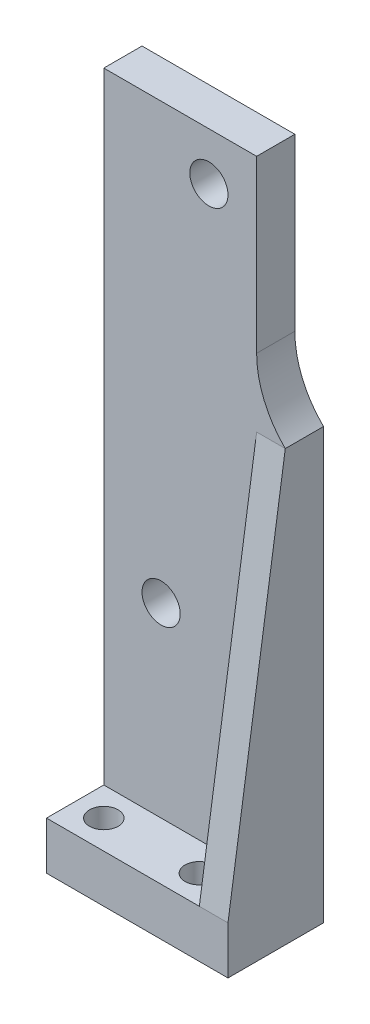
ISO-10303-21;
HEADER;
FILE_DESCRIPTION(('STEP AP214'),'2;1');
FILE_NAME('part.step','',(''),(''),'','','');
FILE_SCHEMA(('AUTOMOTIVE_DESIGN { 1 0 10303 214 1 1 1 1 }'));
ENDSEC;
DATA;
#1=APPLICATION_CONTEXT('core data for automotive mechanical design processes');
#2=APPLICATION_PROTOCOL_DEFINITION('international standard','automotive_design',2000,#1);
#3=PRODUCT_CONTEXT('',#1,'mechanical');
#4=PRODUCT('Part','Part','',(#3));
#5=PRODUCT_RELATED_PRODUCT_CATEGORY('part','',(#4));
#6=PRODUCT_DEFINITION_FORMATION('','',#4);
#7=PRODUCT_DEFINITION_CONTEXT('part definition',#1,'design');
#8=PRODUCT_DEFINITION('design','',#6,#7);
#9=PRODUCT_DEFINITION_SHAPE('','',#8);
#10=(LENGTH_UNIT() NAMED_UNIT(*) SI_UNIT(.MILLI.,.METRE.));
#11=(NAMED_UNIT(*) PLANE_ANGLE_UNIT() SI_UNIT($,.RADIAN.));
#12=(NAMED_UNIT(*) SI_UNIT($,.STERADIAN.) SOLID_ANGLE_UNIT());
#13=UNCERTAINTY_MEASURE_WITH_UNIT(LENGTH_MEASURE(1.E-05),#10,'distance_accuracy_value','');
#14=(GEOMETRIC_REPRESENTATION_CONTEXT(3) GLOBAL_UNCERTAINTY_ASSIGNED_CONTEXT((#13)) GLOBAL_UNIT_ASSIGNED_CONTEXT((#10,
#11,#12)) REPRESENTATION_CONTEXT('',''));
#15=CARTESIAN_POINT('',(0.,0.,0.));
#16=DIRECTION('',(0.,0.,1.));
#17=DIRECTION('',(1.,0.,0.));
#18=AXIS2_PLACEMENT_3D('',#15,#16,#17);
#19=CARTESIAN_POINT('',(5.,65.,3.));
#20=DIRECTION('',(0.,0.,-1.));
#21=DIRECTION('',(-1.,0.,0.));
#22=AXIS2_PLACEMENT_3D('',#19,#20,#21);
#23=CYLINDRICAL_SURFACE('',#22,2.);
#24=CARTESIAN_POINT('',(5.,65.,-3.));
#25=DIRECTION('',(0.,0.,1.));
#26=DIRECTION('',(1.,0.,0.));
#27=AXIS2_PLACEMENT_3D('',#24,#25,#26);
#28=CIRCLE('',#27,2.);
#29=CARTESIAN_POINT('',(7.,65.,-3.));
#30=VERTEX_POINT('',#29);
#31=EDGE_CURVE('E211',#30,#30,#28,.T.);
#32=ORIENTED_EDGE('',*,*,#31,.T.);
#33=EDGE_LOOP('',(#32));
#34=FACE_BOUND('',#33,.T.);
#35=CARTESIAN_POINT('',(5.,65.,-6.2));
#36=DIRECTION('',(0.,0.,-1.));
#37=DIRECTION('',(-1.,0.,0.));
#38=AXIS2_PLACEMENT_3D('',#35,#36,#37);
#39=CIRCLE('',#38,2.);
#40=CARTESIAN_POINT('',(3.,65.,-6.2));
#41=VERTEX_POINT('',#40);
#42=EDGE_CURVE('E154',#41,#41,#39,.F.);
#43=ORIENTED_EDGE('',*,*,#42,.F.);
#44=EDGE_LOOP('',(#43));
#45=FACE_BOUND('',#44,.T.);
#46=ADVANCED_FACE('F43',(#34,#45),#23,.F.);
#47=CARTESIAN_POINT('',(0.,5.,3.));
#48=DIRECTION('',(0.,0.,-1.));
#49=DIRECTION('',(-1.,0.,0.));
#50=AXIS2_PLACEMENT_3D('',#47,#48,#49);
#51=PLANE('',#50);
#52=DIRECTION('',(1.,0.,0.));
#53=VECTOR('',#52,1.);
#54=CARTESIAN_POINT('',(0.,0.,3.));
#55=LINE('',#54,#53);
#56=CARTESIAN_POINT('',(-6.,0.,3.));
#57=VERTEX_POINT('',#56);
#58=CARTESIAN_POINT('',(13.,0.,3.));
#59=VERTEX_POINT('',#58);
#60=EDGE_CURVE('E206',#57,#59,#55,.T.);
#61=ORIENTED_EDGE('',*,*,#60,.T.);
#62=DIRECTION('',(0.,-1.,0.));
#63=VECTOR('',#62,1.);
#64=CARTESIAN_POINT('',(13.,0.,3.));
#65=LINE('',#64,#63);
#66=CARTESIAN_POINT('',(13.,5.,3.));
#67=VERTEX_POINT('',#66);
#68=EDGE_CURVE('E140',#67,#59,#65,.T.);
#69=ORIENTED_EDGE('',*,*,#68,.F.);
#70=DIRECTION('',(-1.,0.,0.));
#71=VECTOR('',#70,1.);
#72=CARTESIAN_POINT('',(13.,5.,3.));
#73=LINE('',#72,#71);
#74=CARTESIAN_POINT('',(10.,5.,3.));
#75=VERTEX_POINT('',#74);
#76=EDGE_CURVE('E138',#67,#75,#73,.T.);
#77=ORIENTED_EDGE('',*,*,#76,.T.);
#78=DIRECTION('',(1.,0.,0.));
#79=VECTOR('',#78,1.);
#80=CARTESIAN_POINT('',(0.,5.,3.));
#81=LINE('',#80,#79);
#82=CARTESIAN_POINT('',(-6.,5.,3.));
#83=VERTEX_POINT('',#82);
#84=EDGE_CURVE('E191',#83,#75,#81,.T.);
#85=ORIENTED_EDGE('',*,*,#84,.F.);
#86=DIRECTION('',(0.,-1.,0.));
#87=VECTOR('',#86,1.);
#88=CARTESIAN_POINT('',(-6.,5.,3.));
#89=LINE('',#88,#87);
#90=EDGE_CURVE('E200',#83,#57,#89,.T.);
#91=ORIENTED_EDGE('',*,*,#90,.T.);
#92=EDGE_LOOP('',(#61,#69,#77,#85,#91));
#93=FACE_BOUND('',#92,.T.);
#94=ADVANCED_FACE('F239',(#93),#51,.F.);
#95=CARTESIAN_POINT('',(10.,5.,0.));
#96=DIRECTION('',(1.,0.,0.));
#97=DIRECTION('',(0.,0.,-1.));
#98=AXIS2_PLACEMENT_3D('',#95,#96,#97);
#99=PLANE('',#98);
#100=DIRECTION('',(0.,1.,0.));
#101=VECTOR('',#100,1.);
#102=CARTESIAN_POINT('',(10.,0.,-3.));
#103=LINE('',#102,#101);
#104=CARTESIAN_POINT('',(10.,52.1414284285429,-3.));
#105=VERTEX_POINT('',#104);
#106=CARTESIAN_POINT('',(10.,70.,-3.));
#107=VERTEX_POINT('',#106);
#108=EDGE_CURVE('E175',#105,#107,#103,.T.);
#109=ORIENTED_EDGE('',*,*,#108,.F.);
#110=DIRECTION('',(0.,0.,-1.));
#111=VECTOR('',#110,1.);
#112=CARTESIAN_POINT('',(10.,52.1414284285429,-7.));
#113=LINE('',#112,#111);
#114=CARTESIAN_POINT('',(10.,52.1414284285429,-7.));
#115=VERTEX_POINT('',#114);
#116=EDGE_CURVE('E116',#105,#115,#113,.T.);
#117=ORIENTED_EDGE('',*,*,#116,.T.);
#118=DIRECTION('',(0.,1.,0.));
#119=VECTOR('',#118,1.);
#120=CARTESIAN_POINT('',(10.,0.,-7.));
#121=LINE('',#120,#119);
#122=CARTESIAN_POINT('',(10.,70.,-7.));
#123=VERTEX_POINT('',#122);
#124=EDGE_CURVE('E163',#115,#123,#121,.T.);
#125=ORIENTED_EDGE('',*,*,#124,.T.);
#126=DIRECTION('',(0.,0.,1.));
#127=VECTOR('',#126,1.);
#128=CARTESIAN_POINT('',(10.,70.,-7.));
#129=LINE('',#128,#127);
#130=EDGE_CURVE('E172',#123,#107,#129,.T.);
#131=ORIENTED_EDGE('',*,*,#130,.T.);
#132=EDGE_LOOP('',(#109,#117,#125,#131));
#133=FACE_BOUND('',#132,.T.);
#134=ADVANCED_FACE('F219',(#133),#99,.T.);
#135=CARTESIAN_POINT('',(-3.,5.,0.));
#136=DIRECTION('',(0.,-1.,0.));
#137=DIRECTION('',(0.,0.,-1.));
#138=AXIS2_PLACEMENT_3D('',#135,#136,#137);
#139=CYLINDRICAL_SURFACE('',#138,1.5);
#140=CARTESIAN_POINT('',(-3.,5.,0.));
#141=DIRECTION('',(0.,1.,0.));
#142=DIRECTION('',(0.,0.,1.));
#143=AXIS2_PLACEMENT_3D('',#140,#141,#142);
#144=CIRCLE('',#143,1.5);
#145=CARTESIAN_POINT('',(-3.,5.,1.5));
#146=VERTEX_POINT('',#145);
#147=EDGE_CURVE('E187',#146,#146,#144,.T.);
#148=ORIENTED_EDGE('',*,*,#147,.T.);
#149=EDGE_LOOP('',(#148));
#150=FACE_BOUND('',#149,.T.);
#151=CARTESIAN_POINT('',(-3.,0.,0.));
#152=DIRECTION('',(0.,1.,0.));
#153=DIRECTION('',(0.,0.,1.));
#154=AXIS2_PLACEMENT_3D('',#151,#152,#153);
#155=CIRCLE('',#154,1.5);
#156=CARTESIAN_POINT('',(-3.,0.,1.5));
#157=VERTEX_POINT('',#156);
#158=EDGE_CURVE('E203',#157,#157,#155,.T.);
#159=ORIENTED_EDGE('',*,*,#158,.F.);
#160=EDGE_LOOP('',(#159));
#161=FACE_BOUND('',#160,.T.);
#162=ADVANCED_FACE('F439',(#150,#161),#139,.F.);
#163=CARTESIAN_POINT('',(7.,5.,0.));
#164=DIRECTION('',(0.,-1.,0.));
#165=DIRECTION('',(0.,0.,-1.));
#166=AXIS2_PLACEMENT_3D('',#163,#164,#165);
#167=CYLINDRICAL_SURFACE('',#166,1.5);
#168=CARTESIAN_POINT('',(7.,5.,0.));
#169=DIRECTION('',(0.,1.,0.));
#170=DIRECTION('',(0.,0.,1.));
#171=AXIS2_PLACEMENT_3D('',#168,#169,#170);
#172=CIRCLE('',#171,1.5);
#173=CARTESIAN_POINT('',(7.,5.,1.5));
#174=VERTEX_POINT('',#173);
#175=EDGE_CURVE('E184',#174,#174,#172,.T.);
#176=ORIENTED_EDGE('',*,*,#175,.T.);
#177=EDGE_LOOP('',(#176));
#178=FACE_BOUND('',#177,.T.);
#179=CARTESIAN_POINT('',(7.,0.,0.));
#180=DIRECTION('',(0.,1.,0.));
#181=DIRECTION('',(0.,0.,1.));
#182=AXIS2_PLACEMENT_3D('',#179,#180,#181);
#183=CIRCLE('',#182,1.5);
#184=CARTESIAN_POINT('',(7.,0.,1.5));
#185=VERTEX_POINT('',#184);
#186=EDGE_CURVE('E181',#185,#185,#183,.T.);
#187=ORIENTED_EDGE('',*,*,#186,.F.);
#188=EDGE_LOOP('',(#187));
#189=FACE_BOUND('',#188,.T.);
#190=ADVANCED_FACE('F430',(#178,#189),#167,.F.);
#191=CARTESIAN_POINT('',(-6.,5.,0.));
#192=DIRECTION('',(1.,0.,0.));
#193=DIRECTION('',(0.,0.,-1.));
#194=AXIS2_PLACEMENT_3D('',#191,#192,#193);
#195=PLANE('',#194);
#196=DIRECTION('',(0.,0.,1.));
#197=VECTOR('',#196,1.);
#198=CARTESIAN_POINT('',(-6.,0.,0.));
#199=LINE('',#198,#197);
#200=CARTESIAN_POINT('',(-6.,0.,-7.));
#201=VERTEX_POINT('',#200);
#202=EDGE_CURVE('E188',#201,#57,#199,.T.);
#203=ORIENTED_EDGE('',*,*,#202,.T.);
#204=ORIENTED_EDGE('',*,*,#90,.F.);
#205=DIRECTION('',(0.,0.,1.));
#206=VECTOR('',#205,1.);
#207=CARTESIAN_POINT('',(-6.,5.,0.));
#208=LINE('',#207,#206);
#209=CARTESIAN_POINT('',(-6.,5.,-3.));
#210=VERTEX_POINT('',#209);
#211=EDGE_CURVE('E198',#210,#83,#208,.T.);
#212=ORIENTED_EDGE('',*,*,#211,.F.);
#213=DIRECTION('',(0.,-1.,0.));
#214=VECTOR('',#213,1.);
#215=CARTESIAN_POINT('',(-5.99999999999999,70.,-3.));
#216=LINE('',#215,#214);
#217=CARTESIAN_POINT('',(-5.99999999999999,70.,-3.));
#218=VERTEX_POINT('',#217);
#219=EDGE_CURVE('E164',#218,#210,#216,.T.);
#220=ORIENTED_EDGE('',*,*,#219,.F.);
#221=DIRECTION('',(0.,0.,1.));
#222=VECTOR('',#221,1.);
#223=CARTESIAN_POINT('',(-5.99999999999999,70.,-7.));
#224=LINE('',#223,#222);
#225=CARTESIAN_POINT('',(-5.99999999999999,70.,-7.));
#226=VERTEX_POINT('',#225);
#227=EDGE_CURVE('E179',#226,#218,#224,.T.);
#228=ORIENTED_EDGE('',*,*,#227,.F.);
#229=DIRECTION('',(0.,-1.,0.));
#230=VECTOR('',#229,1.);
#231=CARTESIAN_POINT('',(-5.99999999999999,70.,-7.));
#232=LINE('',#231,#230);
#233=EDGE_CURVE('E169',#226,#201,#232,.T.);
#234=ORIENTED_EDGE('',*,*,#233,.T.);
#235=EDGE_LOOP('',(#203,#204,#212,#220,#228,#234));
#236=FACE_BOUND('',#235,.T.);
#237=ADVANCED_FACE('F230',(#236),#195,.F.);
#238=CARTESIAN_POINT('',(0.,5.,0.));
#239=DIRECTION('',(0.,1.,0.));
#240=DIRECTION('',(0.,0.,1.));
#241=AXIS2_PLACEMENT_3D('',#238,#239,#240);
#242=PLANE('',#241);
#243=ORIENTED_EDGE('',*,*,#175,.F.);
#244=EDGE_LOOP('',(#243));
#245=FACE_BOUND('',#244,.T.);
#246=ORIENTED_EDGE('',*,*,#147,.F.);
#247=EDGE_LOOP('',(#246));
#248=FACE_BOUND('',#247,.T.);
#249=ORIENTED_EDGE('',*,*,#84,.T.);
#250=DIRECTION('',(0.,0.,1.));
#251=VECTOR('',#250,1.);
#252=CARTESIAN_POINT('',(10.,5.,0.));
#253=LINE('',#252,#251);
#254=CARTESIAN_POINT('',(10.,5.,-3.));
#255=VERTEX_POINT('',#254);
#256=EDGE_CURVE('E193',#255,#75,#253,.T.);
#257=ORIENTED_EDGE('',*,*,#256,.F.);
#258=DIRECTION('',(1.,0.,0.));
#259=VECTOR('',#258,1.);
#260=CARTESIAN_POINT('',(0.,5.,-3.));
#261=LINE('',#260,#259);
#262=EDGE_CURVE('E196',#210,#255,#261,.T.);
#263=ORIENTED_EDGE('',*,*,#262,.F.);
#264=ORIENTED_EDGE('',*,*,#211,.T.);
#265=EDGE_LOOP('',(#249,#257,#263,#264));
#266=FACE_BOUND('',#265,.T.);
#267=ADVANCED_FACE('F235',(#245,#248,#266),#242,.T.);
#268=CARTESIAN_POINT('',(0.,0.,0.));
#269=DIRECTION('',(0.,1.,0.));
#270=DIRECTION('',(0.,0.,1.));
#271=AXIS2_PLACEMENT_3D('',#268,#269,#270);
#272=PLANE('',#271);
#273=ORIENTED_EDGE('',*,*,#186,.T.);
#274=EDGE_LOOP('',(#273));
#275=FACE_BOUND('',#274,.T.);
#276=ORIENTED_EDGE('',*,*,#158,.T.);
#277=EDGE_LOOP('',(#276));
#278=FACE_BOUND('',#277,.T.);
#279=ORIENTED_EDGE('',*,*,#60,.F.);
#280=ORIENTED_EDGE('',*,*,#202,.F.);
#281=DIRECTION('',(1.,0.,0.));
#282=VECTOR('',#281,1.);
#283=CARTESIAN_POINT('',(-6.,0.,-7.));
#284=LINE('',#283,#282);
#285=CARTESIAN_POINT('',(13.,0.,-7.));
#286=VERTEX_POINT('',#285);
#287=EDGE_CURVE('E161',#201,#286,#284,.T.);
#288=ORIENTED_EDGE('',*,*,#287,.T.);
#289=DIRECTION('',(0.,0.,-1.));
#290=VECTOR('',#289,1.);
#291=CARTESIAN_POINT('',(13.,0.,0.));
#292=LINE('',#291,#290);
#293=EDGE_CURVE('E142',#59,#286,#292,.T.);
#294=ORIENTED_EDGE('',*,*,#293,.F.);
#295=EDGE_LOOP('',(#279,#280,#288,#294));
#296=FACE_BOUND('',#295,.T.);
#297=ADVANCED_FACE('F243',(#275,#278,#296),#272,.F.);
#298=CARTESIAN_POINT('',(10.,70.,-7.));
#299=DIRECTION('',(0.,1.,0.));
#300=DIRECTION('',(0.,0.,1.));
#301=AXIS2_PLACEMENT_3D('',#298,#299,#300);
#302=PLANE('',#301);
#303=DIRECTION('',(-1.,0.,0.));
#304=VECTOR('',#303,1.);
#305=CARTESIAN_POINT('',(10.,70.,-3.));
#306=LINE('',#305,#304);
#307=EDGE_CURVE('E174',#107,#218,#306,.T.);
#308=ORIENTED_EDGE('',*,*,#307,.F.);
#309=ORIENTED_EDGE('',*,*,#130,.F.);
#310=DIRECTION('',(-1.,0.,0.));
#311=VECTOR('',#310,1.);
#312=CARTESIAN_POINT('',(10.,70.,-7.));
#313=LINE('',#312,#311);
#314=EDGE_CURVE('E166',#123,#226,#313,.T.);
#315=ORIENTED_EDGE('',*,*,#314,.T.);
#316=ORIENTED_EDGE('',*,*,#227,.T.);
#317=EDGE_LOOP('',(#308,#309,#315,#316));
#318=FACE_BOUND('',#317,.T.);
#319=ADVANCED_FACE('F227',(#318),#302,.T.);
#320=CARTESIAN_POINT('',(0.,0.,-7.));
#321=DIRECTION('',(0.,0.,1.));
#322=DIRECTION('',(1.,0.,0.));
#323=AXIS2_PLACEMENT_3D('',#320,#321,#322);
#324=PLANE('',#323);
#325=CARTESIAN_POINT('',(5.,65.,-7.));
#326=DIRECTION('',(0.,0.,-1.));
#327=DIRECTION('',(-1.,0.,0.));
#328=AXIS2_PLACEMENT_3D('',#325,#326,#327);
#329=CIRCLE('',#328,3.5);
#330=CARTESIAN_POINT('',(1.5,65.,-7.));
#331=VERTEX_POINT('',#330);
#332=EDGE_CURVE('E150',#331,#331,#329,.T.);
#333=ORIENTED_EDGE('',*,*,#332,.F.);
#334=EDGE_LOOP('',(#333));
#335=FACE_BOUND('',#334,.T.);
#336=CARTESIAN_POINT('',(0.,24.5,-7.));
#337=DIRECTION('',(0.,0.,-1.));
#338=DIRECTION('',(-1.,0.,0.));
#339=AXIS2_PLACEMENT_3D('',#336,#337,#338);
#340=CIRCLE('',#339,2.);
#341=CARTESIAN_POINT('',(-2.,24.5,-7.));
#342=VERTEX_POINT('',#341);
#343=EDGE_CURVE('E157',#342,#342,#340,.T.);
#344=ORIENTED_EDGE('',*,*,#343,.F.);
#345=EDGE_LOOP('',(#344));
#346=FACE_BOUND('',#345,.T.);
#347=ORIENTED_EDGE('',*,*,#287,.F.);
#348=ORIENTED_EDGE('',*,*,#233,.F.);
#349=ORIENTED_EDGE('',*,*,#314,.F.);
#350=ORIENTED_EDGE('',*,*,#124,.F.);
#351=CARTESIAN_POINT('',(20.,52.1414284285429,-7.));
#352=DIRECTION('',(0.,0.,1.));
#353=DIRECTION('',(1.,0.,0.));
#354=AXIS2_PLACEMENT_3D('',#351,#352,#353);
#355=CIRCLE('',#354,10.);
#356=CARTESIAN_POINT('',(13.,45.,-7.));
#357=VERTEX_POINT('',#356);
#358=EDGE_CURVE('E52',#115,#357,#355,.T.);
#359=ORIENTED_EDGE('',*,*,#358,.T.);
#360=DIRECTION('',(0.,1.,0.));
#361=VECTOR('',#360,1.);
#362=CARTESIAN_POINT('',(13.,0.,-7.));
#363=LINE('',#362,#361);
#364=EDGE_CURVE('E134',#286,#357,#363,.T.);
#365=ORIENTED_EDGE('',*,*,#364,.F.);
#366=EDGE_LOOP('',(#347,#348,#349,#350,#359,#365));
#367=FACE_BOUND('',#366,.T.);
#368=ADVANCED_FACE('F223',(#335,#346,#367),#324,.F.);
#369=CARTESIAN_POINT('',(0.,0.,-3.));
#370=DIRECTION('',(0.,0.,1.));
#371=DIRECTION('',(1.,0.,0.));
#372=AXIS2_PLACEMENT_3D('',#369,#370,#371);
#373=PLANE('',#372);
#374=CARTESIAN_POINT('',(0.,24.5,-3.));
#375=DIRECTION('',(0.,0.,1.));
#376=DIRECTION('',(1.,0.,0.));
#377=AXIS2_PLACEMENT_3D('',#374,#375,#376);
#378=CIRCLE('',#377,2.);
#379=CARTESIAN_POINT('',(2.,24.5,-3.));
#380=VERTEX_POINT('',#379);
#381=EDGE_CURVE('E160',#380,#380,#378,.T.);
#382=ORIENTED_EDGE('',*,*,#381,.F.);
#383=EDGE_LOOP('',(#382));
#384=FACE_BOUND('',#383,.T.);
#385=ORIENTED_EDGE('',*,*,#31,.F.);
#386=EDGE_LOOP('',(#385));
#387=FACE_BOUND('',#386,.T.);
#388=ORIENTED_EDGE('',*,*,#219,.T.);
#389=ORIENTED_EDGE('',*,*,#262,.T.);
#390=CARTESIAN_POINT('',(10.,45.,-3.));
#391=VERTEX_POINT('',#390);
#392=EDGE_CURVE('E123',#255,#391,#103,.T.);
#393=ORIENTED_EDGE('',*,*,#392,.T.);
#394=DIRECTION('',(1.,0.,0.));
#395=VECTOR('',#394,1.);
#396=CARTESIAN_POINT('',(0.,45.,-3.));
#397=LINE('',#396,#395);
#398=CARTESIAN_POINT('',(12.9999999999996,45.,-3.));
#399=VERTEX_POINT('',#398);
#400=EDGE_CURVE('E11',#391,#399,#397,.T.);
#401=ORIENTED_EDGE('',*,*,#400,.T.);
#402=CARTESIAN_POINT('',(20.,52.1414284285429,-3.));
#403=DIRECTION('',(0.,0.,1.));
#404=DIRECTION('',(1.,0.,0.));
#405=AXIS2_PLACEMENT_3D('',#402,#403,#404);
#406=CIRCLE('',#405,10.);
#407=EDGE_CURVE('E58',#399,#105,#406,.F.);
#408=ORIENTED_EDGE('',*,*,#407,.T.);
#409=ORIENTED_EDGE('',*,*,#108,.T.);
#410=ORIENTED_EDGE('',*,*,#307,.T.);
#411=EDGE_LOOP('',(#388,#389,#393,#401,#408,#409,#410));
#412=FACE_BOUND('',#411,.T.);
#413=ADVANCED_FACE('F120',(#384,#387,#412),#373,.T.);
#414=CARTESIAN_POINT('',(0.,24.5,3.));
#415=DIRECTION('',(0.,0.,-1.));
#416=DIRECTION('',(-1.,0.,0.));
#417=AXIS2_PLACEMENT_3D('',#414,#415,#416);
#418=CYLINDRICAL_SURFACE('',#417,2.);
#419=ORIENTED_EDGE('',*,*,#381,.T.);
#420=EDGE_LOOP('',(#419));
#421=FACE_BOUND('',#420,.T.);
#422=ORIENTED_EDGE('',*,*,#343,.T.);
#423=EDGE_LOOP('',(#422));
#424=FACE_BOUND('',#423,.T.);
#425=ADVANCED_FACE('F266',(#421,#424),#418,.F.);
#426=CARTESIAN_POINT('',(5.,65.,-6.2));
#427=DIRECTION('',(0.,0.,-1.));
#428=DIRECTION('',(-1.,0.,0.));
#429=AXIS2_PLACEMENT_3D('',#426,#427,#428);
#430=PLANE('',#429);
#431=CARTESIAN_POINT('',(5.,65.,-6.2));
#432=DIRECTION('',(0.,0.,-1.));
#433=DIRECTION('',(-1.,0.,0.));
#434=AXIS2_PLACEMENT_3D('',#431,#432,#433);
#435=CIRCLE('',#434,3.5);
#436=CARTESIAN_POINT('',(1.5,65.,-6.2));
#437=VERTEX_POINT('',#436);
#438=EDGE_CURVE('E151',#437,#437,#435,.T.);
#439=ORIENTED_EDGE('',*,*,#438,.T.);
#440=EDGE_LOOP('',(#439));
#441=FACE_BOUND('',#440,.T.);
#442=ORIENTED_EDGE('',*,*,#42,.T.);
#443=EDGE_LOOP('',(#442));
#444=FACE_BOUND('',#443,.T.);
#445=ADVANCED_FACE('F276',(#441,#444),#430,.T.);
#446=CARTESIAN_POINT('',(5.,65.,-6.2));
#447=DIRECTION('',(0.,0.,-1.));
#448=DIRECTION('',(-1.,0.,0.));
#449=AXIS2_PLACEMENT_3D('',#446,#447,#448);
#450=CYLINDRICAL_SURFACE('',#449,3.5);
#451=ORIENTED_EDGE('',*,*,#438,.F.);
#452=EDGE_LOOP('',(#451));
#453=FACE_BOUND('',#452,.T.);
#454=ORIENTED_EDGE('',*,*,#332,.T.);
#455=EDGE_LOOP('',(#454));
#456=FACE_BOUND('',#455,.T.);
#457=ADVANCED_FACE('F287',(#453,#456),#450,.F.);
#458=CARTESIAN_POINT('',(13.,0.550122249388753,3.66748166259169));
#459=DIRECTION('',(0.,-0.148340452930245,-0.988936352868298));
#460=DIRECTION('',(0.,0.988936352868298,-0.148340452930245));
#461=AXIS2_PLACEMENT_3D('',#458,#459,#460);
#462=PLANE('',#461);
#463=DIRECTION('',(0.,-0.988936352868298,0.148340452930245));
#464=VECTOR('',#463,1.);
#465=CARTESIAN_POINT('',(10.,0.550122249388753,3.66748166259169));
#466=LINE('',#465,#464);
#467=EDGE_CURVE('E147',#391,#75,#466,.T.);
#468=ORIENTED_EDGE('',*,*,#467,.T.);
#469=ORIENTED_EDGE('',*,*,#76,.F.);
#470=DIRECTION('',(0.,-0.988936352868298,0.148340452930245));
#471=VECTOR('',#470,1.);
#472=CARTESIAN_POINT('',(13.,0.550122249388753,3.66748166259169));
#473=LINE('',#472,#471);
#474=EDGE_CURVE('E131',#399,#67,#473,.T.);
#475=ORIENTED_EDGE('',*,*,#474,.F.);
#476=ORIENTED_EDGE('',*,*,#400,.F.);
#477=EDGE_LOOP('',(#468,#469,#475,#476));
#478=FACE_BOUND('',#477,.T.);
#479=ADVANCED_FACE('F136',(#478),#462,.F.);
#480=CARTESIAN_POINT('',(13.,0.,0.));
#481=DIRECTION('',(1.,0.,0.));
#482=DIRECTION('',(0.,0.,-1.));
#483=AXIS2_PLACEMENT_3D('',#480,#481,#482);
#484=PLANE('',#483);
#485=ORIENTED_EDGE('',*,*,#364,.T.);
#486=DIRECTION('',(0.,0.,1.));
#487=VECTOR('',#486,1.);
#488=CARTESIAN_POINT('',(13.,45.,0.));
#489=LINE('',#488,#487);
#490=EDGE_CURVE('E115',#357,#399,#489,.T.);
#491=ORIENTED_EDGE('',*,*,#490,.T.);
#492=ORIENTED_EDGE('',*,*,#474,.T.);
#493=ORIENTED_EDGE('',*,*,#68,.T.);
#494=ORIENTED_EDGE('',*,*,#293,.T.);
#495=EDGE_LOOP('',(#485,#491,#492,#493,#494));
#496=FACE_BOUND('',#495,.T.);
#497=ADVANCED_FACE('F129',(#496),#484,.T.);
#498=CARTESIAN_POINT('',(10.,0.,0.));
#499=DIRECTION('',(1.,0.,0.));
#500=DIRECTION('',(0.,0.,-1.));
#501=AXIS2_PLACEMENT_3D('',#498,#499,#500);
#502=PLANE('',#501);
#503=ORIENTED_EDGE('',*,*,#392,.F.);
#504=ORIENTED_EDGE('',*,*,#256,.T.);
#505=ORIENTED_EDGE('',*,*,#467,.F.);
#506=EDGE_LOOP('',(#503,#504,#505));
#507=FACE_BOUND('',#506,.T.);
#508=ADVANCED_FACE('F237',(#507),#502,.F.);
#509=CARTESIAN_POINT('',(20.,52.1414284285429,0.));
#510=DIRECTION('',(0.,0.,1.));
#511=DIRECTION('',(1.,0.,0.));
#512=AXIS2_PLACEMENT_3D('',#509,#510,#511);
#513=CYLINDRICAL_SURFACE('',#512,10.);
#514=ORIENTED_EDGE('',*,*,#358,.F.);
#515=ORIENTED_EDGE('',*,*,#116,.F.);
#516=ORIENTED_EDGE('',*,*,#407,.F.);
#517=ORIENTED_EDGE('',*,*,#490,.F.);
#518=EDGE_LOOP('',(#514,#515,#516,#517));
#519=FACE_BOUND('',#518,.T.);
#520=ADVANCED_FACE('F45',(#519),#513,.F.);
#521=CLOSED_SHELL('',(#46,#94,#134,#162,#190,#237,#267,#297,#319,#368,#413,#425,#445,#457,#479,
#497,#508,#520));
#522=MANIFOLD_SOLID_BREP('B2',#521);
#523=ADVANCED_BREP_SHAPE_REPRESENTATION('',(#18,#522),#14);
#524=SHAPE_DEFINITION_REPRESENTATION(#9,#523);
ENDSEC;
END-ISO-10303-21;
